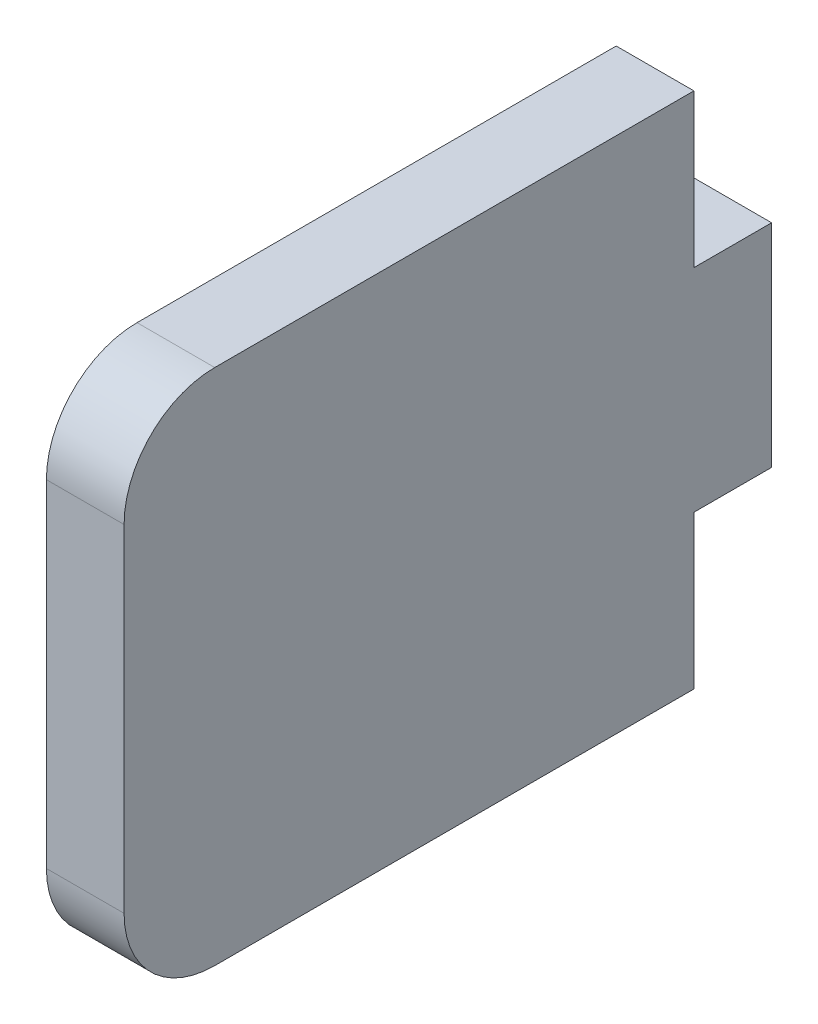
ISO-10303-21;
HEADER;
FILE_DESCRIPTION(('STEP AP214'),'2;1');
FILE_NAME('part.step','',(''),(''),'','','');
FILE_SCHEMA(('AUTOMOTIVE_DESIGN { 1 0 10303 214 1 1 1 1 }'));
ENDSEC;
DATA;
#1=APPLICATION_CONTEXT('core data for automotive mechanical design processes');
#2=APPLICATION_PROTOCOL_DEFINITION('international standard','automotive_design',2000,#1);
#3=PRODUCT_CONTEXT('',#1,'mechanical');
#4=PRODUCT('Part','Part','',(#3));
#5=PRODUCT_RELATED_PRODUCT_CATEGORY('part','',(#4));
#6=PRODUCT_DEFINITION_FORMATION('','',#4);
#7=PRODUCT_DEFINITION_CONTEXT('part definition',#1,'design');
#8=PRODUCT_DEFINITION('design','',#6,#7);
#9=PRODUCT_DEFINITION_SHAPE('','',#8);
#10=(LENGTH_UNIT() NAMED_UNIT(*) SI_UNIT(.MILLI.,.METRE.));
#11=(NAMED_UNIT(*) PLANE_ANGLE_UNIT() SI_UNIT($,.RADIAN.));
#12=(NAMED_UNIT(*) SI_UNIT($,.STERADIAN.) SOLID_ANGLE_UNIT());
#13=UNCERTAINTY_MEASURE_WITH_UNIT(LENGTH_MEASURE(1.E-05),#10,'distance_accuracy_value','');
#14=(GEOMETRIC_REPRESENTATION_CONTEXT(3) GLOBAL_UNCERTAINTY_ASSIGNED_CONTEXT((#13)) GLOBAL_UNIT_ASSIGNED_CONTEXT((#10,
#11,#12)) REPRESENTATION_CONTEXT('',''));
#15=CARTESIAN_POINT('',(0.,0.,0.));
#16=DIRECTION('',(0.,0.,1.));
#17=DIRECTION('',(1.,0.,0.));
#18=AXIS2_PLACEMENT_3D('',#15,#16,#17);
#19=CARTESIAN_POINT('',(3.,-10.,11.));
#20=DIRECTION('',(0.,0.,-1.));
#21=DIRECTION('',(-1.,0.,0.));
#22=AXIS2_PLACEMENT_3D('',#19,#20,#21);
#23=PLANE('',#22);
#24=DIRECTION('',(0.,-1.,0.));
#25=VECTOR('',#24,1.);
#26=CARTESIAN_POINT('',(0.,-10.,11.));
#27=LINE('',#26,#25);
#28=CARTESIAN_POINT('',(0.,6.5,11.));
#29=VERTEX_POINT('',#28);
#30=CARTESIAN_POINT('',(0.,-6.5,11.));
#31=VERTEX_POINT('',#30);
#32=EDGE_CURVE('E154',#29,#31,#27,.T.);
#33=ORIENTED_EDGE('',*,*,#32,.T.);
#34=DIRECTION('',(-1.,0.,0.));
#35=VECTOR('',#34,1.);
#36=CARTESIAN_POINT('',(3.,-6.5,11.));
#37=LINE('',#36,#35);
#38=CARTESIAN_POINT('',(3.,-6.5,11.));
#39=VERTEX_POINT('',#38);
#40=EDGE_CURVE('E58',#31,#39,#37,.F.);
#41=ORIENTED_EDGE('',*,*,#40,.T.);
#42=DIRECTION('',(0.,-1.,0.));
#43=VECTOR('',#42,1.);
#44=CARTESIAN_POINT('',(3.,-10.,11.));
#45=LINE('',#44,#43);
#46=CARTESIAN_POINT('',(3.,6.5,11.));
#47=VERTEX_POINT('',#46);
#48=EDGE_CURVE('E125',#47,#39,#45,.T.);
#49=ORIENTED_EDGE('',*,*,#48,.F.);
#50=DIRECTION('',(-1.,0.,0.));
#51=VECTOR('',#50,1.);
#52=CARTESIAN_POINT('',(3.,6.5,11.));
#53=LINE('',#52,#51);
#54=EDGE_CURVE('E186',#47,#29,#53,.T.);
#55=ORIENTED_EDGE('',*,*,#54,.T.);
#56=EDGE_LOOP('',(#33,#41,#49,#55));
#57=FACE_BOUND('',#56,.T.);
#58=ADVANCED_FACE('F37',(#57),#23,.F.);
#59=CARTESIAN_POINT('',(3.,-10.,-11.));
#60=DIRECTION('',(0.,1.,0.));
#61=DIRECTION('',(0.,0.,1.));
#62=AXIS2_PLACEMENT_3D('',#59,#60,#61);
#63=PLANE('',#62);
#64=DIRECTION('',(0.,0.,-1.));
#65=VECTOR('',#64,1.);
#66=CARTESIAN_POINT('',(3.,-10.,-11.));
#67=LINE('',#66,#65);
#68=CARTESIAN_POINT('',(3.,-10.,7.5));
#69=VERTEX_POINT('',#68);
#70=CARTESIAN_POINT('',(3.,-10.,-11.));
#71=VERTEX_POINT('',#70);
#72=EDGE_CURVE('E115',#69,#71,#67,.T.);
#73=ORIENTED_EDGE('',*,*,#72,.F.);
#74=DIRECTION('',(-1.,0.,0.));
#75=VECTOR('',#74,1.);
#76=CARTESIAN_POINT('',(3.,-10.,7.5));
#77=LINE('',#76,#75);
#78=CARTESIAN_POINT('',(0.,-10.,7.5));
#79=VERTEX_POINT('',#78);
#80=EDGE_CURVE('E134',#69,#79,#77,.T.);
#81=ORIENTED_EDGE('',*,*,#80,.T.);
#82=DIRECTION('',(0.,0.,-1.));
#83=VECTOR('',#82,1.);
#84=CARTESIAN_POINT('',(0.,-10.,-11.));
#85=LINE('',#84,#83);
#86=CARTESIAN_POINT('',(0.,-10.,-11.));
#87=VERTEX_POINT('',#86);
#88=EDGE_CURVE('E131',#79,#87,#85,.T.);
#89=ORIENTED_EDGE('',*,*,#88,.T.);
#90=DIRECTION('',(-1.,0.,0.));
#91=VECTOR('',#90,1.);
#92=CARTESIAN_POINT('',(3.,-10.,-11.));
#93=LINE('',#92,#91);
#94=EDGE_CURVE('E128',#71,#87,#93,.T.);
#95=ORIENTED_EDGE('',*,*,#94,.F.);
#96=EDGE_LOOP('',(#73,#81,#89,#95));
#97=FACE_BOUND('',#96,.T.);
#98=ADVANCED_FACE('F129',(#97),#63,.F.);
#99=CARTESIAN_POINT('',(3.,-4.09,-11.));
#100=DIRECTION('',(0.,0.,1.));
#101=DIRECTION('',(0.,-1.,0.));
#102=AXIS2_PLACEMENT_3D('',#99,#100,#101);
#103=PLANE('',#102);
#104=DIRECTION('',(0.,1.,0.));
#105=VECTOR('',#104,1.);
#106=CARTESIAN_POINT('',(0.,-4.09,-11.));
#107=LINE('',#106,#105);
#108=CARTESIAN_POINT('',(0.,-4.09,-11.));
#109=VERTEX_POINT('',#108);
#110=EDGE_CURVE('E157',#87,#109,#107,.T.);
#111=ORIENTED_EDGE('',*,*,#110,.T.);
#112=DIRECTION('',(-1.,0.,0.));
#113=VECTOR('',#112,1.);
#114=CARTESIAN_POINT('',(3.,-4.09,-11.));
#115=LINE('',#114,#113);
#116=CARTESIAN_POINT('',(3.,-4.09,-11.));
#117=VERTEX_POINT('',#116);
#118=EDGE_CURVE('E135',#117,#109,#115,.T.);
#119=ORIENTED_EDGE('',*,*,#118,.F.);
#120=DIRECTION('',(0.,1.,0.));
#121=VECTOR('',#120,1.);
#122=CARTESIAN_POINT('',(3.,-4.09,-11.));
#123=LINE('',#122,#121);
#124=EDGE_CURVE('E119',#71,#117,#123,.T.);
#125=ORIENTED_EDGE('',*,*,#124,.F.);
#126=ORIENTED_EDGE('',*,*,#94,.T.);
#127=EDGE_LOOP('',(#111,#119,#125,#126));
#128=FACE_BOUND('',#127,.T.);
#129=ADVANCED_FACE('F137',(#128),#103,.F.);
#130=CARTESIAN_POINT('',(3.,-4.09,-14.));
#131=DIRECTION('',(0.,1.,0.));
#132=DIRECTION('',(0.,0.,1.));
#133=AXIS2_PLACEMENT_3D('',#130,#131,#132);
#134=PLANE('',#133);
#135=DIRECTION('',(0.,0.,-1.));
#136=VECTOR('',#135,1.);
#137=CARTESIAN_POINT('',(0.,-4.09,-14.));
#138=LINE('',#137,#136);
#139=CARTESIAN_POINT('',(0.,-4.09,-14.));
#140=VERTEX_POINT('',#139);
#141=EDGE_CURVE('E159',#109,#140,#138,.T.);
#142=ORIENTED_EDGE('',*,*,#141,.T.);
#143=DIRECTION('',(-1.,0.,0.));
#144=VECTOR('',#143,1.);
#145=CARTESIAN_POINT('',(3.,-4.09,-14.));
#146=LINE('',#145,#144);
#147=CARTESIAN_POINT('',(3.,-4.09,-14.));
#148=VERTEX_POINT('',#147);
#149=EDGE_CURVE('E177',#148,#140,#146,.T.);
#150=ORIENTED_EDGE('',*,*,#149,.F.);
#151=DIRECTION('',(0.,0.,-1.));
#152=VECTOR('',#151,1.);
#153=CARTESIAN_POINT('',(3.,-4.09,-14.));
#154=LINE('',#153,#152);
#155=EDGE_CURVE('E140',#117,#148,#154,.T.);
#156=ORIENTED_EDGE('',*,*,#155,.F.);
#157=ORIENTED_EDGE('',*,*,#118,.T.);
#158=EDGE_LOOP('',(#142,#150,#156,#157));
#159=FACE_BOUND('',#158,.T.);
#160=ADVANCED_FACE('F217',(#159),#134,.F.);
#161=CARTESIAN_POINT('',(3.,4.09,-14.));
#162=DIRECTION('',(0.,0.,1.));
#163=DIRECTION('',(1.,0.,0.));
#164=AXIS2_PLACEMENT_3D('',#161,#162,#163);
#165=PLANE('',#164);
#166=DIRECTION('',(0.,1.,0.));
#167=VECTOR('',#166,1.);
#168=CARTESIAN_POINT('',(0.,4.09,-14.));
#169=LINE('',#168,#167);
#170=CARTESIAN_POINT('',(0.,4.09,-14.));
#171=VERTEX_POINT('',#170);
#172=EDGE_CURVE('E161',#140,#171,#169,.T.);
#173=ORIENTED_EDGE('',*,*,#172,.T.);
#174=DIRECTION('',(-1.,0.,0.));
#175=VECTOR('',#174,1.);
#176=CARTESIAN_POINT('',(3.,4.09,-14.));
#177=LINE('',#176,#175);
#178=CARTESIAN_POINT('',(3.,4.09,-14.));
#179=VERTEX_POINT('',#178);
#180=EDGE_CURVE('E174',#179,#171,#177,.T.);
#181=ORIENTED_EDGE('',*,*,#180,.F.);
#182=DIRECTION('',(0.,1.,0.));
#183=VECTOR('',#182,1.);
#184=CARTESIAN_POINT('',(3.,4.09,-14.));
#185=LINE('',#184,#183);
#186=EDGE_CURVE('E142',#148,#179,#185,.T.);
#187=ORIENTED_EDGE('',*,*,#186,.F.);
#188=ORIENTED_EDGE('',*,*,#149,.T.);
#189=EDGE_LOOP('',(#173,#181,#187,#188));
#190=FACE_BOUND('',#189,.T.);
#191=ADVANCED_FACE('F214',(#190),#165,.F.);
#192=CARTESIAN_POINT('',(3.,4.09,-11.));
#193=DIRECTION('',(0.,-1.,0.));
#194=DIRECTION('',(0.,0.,-1.));
#195=AXIS2_PLACEMENT_3D('',#192,#193,#194);
#196=PLANE('',#195);
#197=DIRECTION('',(0.,0.,1.));
#198=VECTOR('',#197,1.);
#199=CARTESIAN_POINT('',(0.,4.09,-11.));
#200=LINE('',#199,#198);
#201=CARTESIAN_POINT('',(0.,4.09,-11.));
#202=VERTEX_POINT('',#201);
#203=EDGE_CURVE('E163',#171,#202,#200,.T.);
#204=ORIENTED_EDGE('',*,*,#203,.T.);
#205=DIRECTION('',(-1.,0.,0.));
#206=VECTOR('',#205,1.);
#207=CARTESIAN_POINT('',(3.,4.09,-11.));
#208=LINE('',#207,#206);
#209=CARTESIAN_POINT('',(3.,4.09,-11.));
#210=VERTEX_POINT('',#209);
#211=EDGE_CURVE('E171',#210,#202,#208,.T.);
#212=ORIENTED_EDGE('',*,*,#211,.F.);
#213=DIRECTION('',(0.,0.,1.));
#214=VECTOR('',#213,1.);
#215=CARTESIAN_POINT('',(3.,4.09,-11.));
#216=LINE('',#215,#214);
#217=EDGE_CURVE('E147',#179,#210,#216,.T.);
#218=ORIENTED_EDGE('',*,*,#217,.F.);
#219=ORIENTED_EDGE('',*,*,#180,.T.);
#220=EDGE_LOOP('',(#204,#212,#218,#219));
#221=FACE_BOUND('',#220,.T.);
#222=ADVANCED_FACE('F209',(#221),#196,.F.);
#223=CARTESIAN_POINT('',(3.,10.,-11.));
#224=DIRECTION('',(0.,0.,1.));
#225=DIRECTION('',(0.,-1.,0.));
#226=AXIS2_PLACEMENT_3D('',#223,#224,#225);
#227=PLANE('',#226);
#228=DIRECTION('',(0.,1.,0.));
#229=VECTOR('',#228,1.);
#230=CARTESIAN_POINT('',(0.,10.,-11.));
#231=LINE('',#230,#229);
#232=CARTESIAN_POINT('',(0.,10.,-11.));
#233=VERTEX_POINT('',#232);
#234=EDGE_CURVE('E165',#202,#233,#231,.T.);
#235=ORIENTED_EDGE('',*,*,#234,.T.);
#236=DIRECTION('',(-1.,0.,0.));
#237=VECTOR('',#236,1.);
#238=CARTESIAN_POINT('',(3.,10.,-11.));
#239=LINE('',#238,#237);
#240=CARTESIAN_POINT('',(3.,10.,-11.));
#241=VERTEX_POINT('',#240);
#242=EDGE_CURVE('E153',#241,#233,#239,.T.);
#243=ORIENTED_EDGE('',*,*,#242,.F.);
#244=DIRECTION('',(0.,1.,0.));
#245=VECTOR('',#244,1.);
#246=CARTESIAN_POINT('',(3.,10.,-11.));
#247=LINE('',#246,#245);
#248=EDGE_CURVE('E149',#210,#241,#247,.T.);
#249=ORIENTED_EDGE('',*,*,#248,.F.);
#250=ORIENTED_EDGE('',*,*,#211,.T.);
#251=EDGE_LOOP('',(#235,#243,#249,#250));
#252=FACE_BOUND('',#251,.T.);
#253=ADVANCED_FACE('F203',(#252),#227,.F.);
#254=CARTESIAN_POINT('',(3.,10.,11.));
#255=DIRECTION('',(0.,-1.,0.));
#256=DIRECTION('',(0.,0.,-1.));
#257=AXIS2_PLACEMENT_3D('',#254,#255,#256);
#258=PLANE('',#257);
#259=DIRECTION('',(0.,0.,1.));
#260=VECTOR('',#259,1.);
#261=CARTESIAN_POINT('',(0.,10.,11.));
#262=LINE('',#261,#260);
#263=CARTESIAN_POINT('',(0.,10.,7.5));
#264=VERTEX_POINT('',#263);
#265=EDGE_CURVE('E167',#233,#264,#262,.T.);
#266=ORIENTED_EDGE('',*,*,#265,.T.);
#267=DIRECTION('',(-1.,0.,0.));
#268=VECTOR('',#267,1.);
#269=CARTESIAN_POINT('',(3.,10.,7.5));
#270=LINE('',#269,#268);
#271=CARTESIAN_POINT('',(3.,10.,7.5));
#272=VERTEX_POINT('',#271);
#273=EDGE_CURVE('E11',#264,#272,#270,.F.);
#274=ORIENTED_EDGE('',*,*,#273,.T.);
#275=DIRECTION('',(0.,0.,1.));
#276=VECTOR('',#275,1.);
#277=CARTESIAN_POINT('',(3.,10.,11.));
#278=LINE('',#277,#276);
#279=EDGE_CURVE('E151',#241,#272,#278,.T.);
#280=ORIENTED_EDGE('',*,*,#279,.F.);
#281=ORIENTED_EDGE('',*,*,#242,.T.);
#282=EDGE_LOOP('',(#266,#274,#280,#281));
#283=FACE_BOUND('',#282,.T.);
#284=ADVANCED_FACE('F199',(#283),#258,.F.);
#285=CARTESIAN_POINT('',(3.,0.,0.));
#286=DIRECTION('',(-1.,0.,0.));
#287=DIRECTION('',(0.,0.,1.));
#288=AXIS2_PLACEMENT_3D('',#285,#286,#287);
#289=PLANE('',#288);
#290=ORIENTED_EDGE('',*,*,#48,.T.);
#291=CARTESIAN_POINT('',(3.,-6.5,7.5));
#292=DIRECTION('',(-1.,0.,0.));
#293=DIRECTION('',(0.,0.,1.));
#294=AXIS2_PLACEMENT_3D('',#291,#292,#293);
#295=CIRCLE('',#294,3.5);
#296=EDGE_CURVE('E45',#39,#69,#295,.F.);
#297=ORIENTED_EDGE('',*,*,#296,.T.);
#298=ORIENTED_EDGE('',*,*,#72,.T.);
#299=ORIENTED_EDGE('',*,*,#124,.T.);
#300=ORIENTED_EDGE('',*,*,#155,.T.);
#301=ORIENTED_EDGE('',*,*,#186,.T.);
#302=ORIENTED_EDGE('',*,*,#217,.T.);
#303=ORIENTED_EDGE('',*,*,#248,.T.);
#304=ORIENTED_EDGE('',*,*,#279,.T.);
#305=CARTESIAN_POINT('',(3.,6.5,7.5));
#306=DIRECTION('',(-1.,0.,0.));
#307=DIRECTION('',(0.,0.,1.));
#308=AXIS2_PLACEMENT_3D('',#305,#306,#307);
#309=CIRCLE('',#308,3.5);
#310=EDGE_CURVE('E190',#272,#47,#309,.F.);
#311=ORIENTED_EDGE('',*,*,#310,.T.);
#312=EDGE_LOOP('',(#290,#297,#298,#299,#300,#301,#302,#303,#304,#311));
#313=FACE_BOUND('',#312,.T.);
#314=ADVANCED_FACE('F117',(#313),#289,.F.);
#315=CARTESIAN_POINT('',(0.,0.,0.));
#316=DIRECTION('',(-1.,0.,0.));
#317=DIRECTION('',(0.,0.,1.));
#318=AXIS2_PLACEMENT_3D('',#315,#316,#317);
#319=PLANE('',#318);
#320=ORIENTED_EDGE('',*,*,#88,.F.);
#321=CARTESIAN_POINT('',(0.,-6.5,7.5));
#322=DIRECTION('',(-1.,0.,0.));
#323=DIRECTION('',(0.,0.,1.));
#324=AXIS2_PLACEMENT_3D('',#321,#322,#323);
#325=CIRCLE('',#324,3.5);
#326=EDGE_CURVE('E184',#79,#31,#325,.T.);
#327=ORIENTED_EDGE('',*,*,#326,.T.);
#328=ORIENTED_EDGE('',*,*,#32,.F.);
#329=CARTESIAN_POINT('',(0.,6.5,7.5));
#330=DIRECTION('',(-1.,0.,0.));
#331=DIRECTION('',(0.,0.,1.));
#332=AXIS2_PLACEMENT_3D('',#329,#330,#331);
#333=CIRCLE('',#332,3.5);
#334=EDGE_CURVE('E182',#29,#264,#333,.T.);
#335=ORIENTED_EDGE('',*,*,#334,.T.);
#336=ORIENTED_EDGE('',*,*,#265,.F.);
#337=ORIENTED_EDGE('',*,*,#234,.F.);
#338=ORIENTED_EDGE('',*,*,#203,.F.);
#339=ORIENTED_EDGE('',*,*,#172,.F.);
#340=ORIENTED_EDGE('',*,*,#141,.F.);
#341=ORIENTED_EDGE('',*,*,#110,.F.);
#342=EDGE_LOOP('',(#320,#327,#328,#335,#336,#337,#338,#339,#340,#341));
#343=FACE_BOUND('',#342,.T.);
#344=ADVANCED_FACE('F197',(#343),#319,.T.);
#345=CARTESIAN_POINT('',(3.,-6.5,7.5));
#346=DIRECTION('',(-1.,0.,0.));
#347=DIRECTION('',(0.,0.,1.));
#348=AXIS2_PLACEMENT_3D('',#345,#346,#347);
#349=CYLINDRICAL_SURFACE('',#348,3.5);
#350=ORIENTED_EDGE('',*,*,#296,.F.);
#351=ORIENTED_EDGE('',*,*,#40,.F.);
#352=ORIENTED_EDGE('',*,*,#326,.F.);
#353=ORIENTED_EDGE('',*,*,#80,.F.);
#354=EDGE_LOOP('',(#350,#351,#352,#353));
#355=FACE_BOUND('',#354,.T.);
#356=ADVANCED_FACE('F219',(#355),#349,.T.);
#357=CARTESIAN_POINT('',(3.,6.5,7.5));
#358=DIRECTION('',(-1.,0.,0.));
#359=DIRECTION('',(0.,0.,1.));
#360=AXIS2_PLACEMENT_3D('',#357,#358,#359);
#361=CYLINDRICAL_SURFACE('',#360,3.5);
#362=ORIENTED_EDGE('',*,*,#310,.F.);
#363=ORIENTED_EDGE('',*,*,#273,.F.);
#364=ORIENTED_EDGE('',*,*,#334,.F.);
#365=ORIENTED_EDGE('',*,*,#54,.F.);
#366=EDGE_LOOP('',(#362,#363,#364,#365));
#367=FACE_BOUND('',#366,.T.);
#368=ADVANCED_FACE('F39',(#367),#361,.T.);
#369=CLOSED_SHELL('',(#58,#98,#129,#160,#191,#222,#253,#284,#314,#344,#356,#368));
#370=MANIFOLD_SOLID_BREP('B2',#369);
#371=ADVANCED_BREP_SHAPE_REPRESENTATION('',(#18,#370),#14);
#372=SHAPE_DEFINITION_REPRESENTATION(#9,#371);
ENDSEC;
END-ISO-10303-21;
